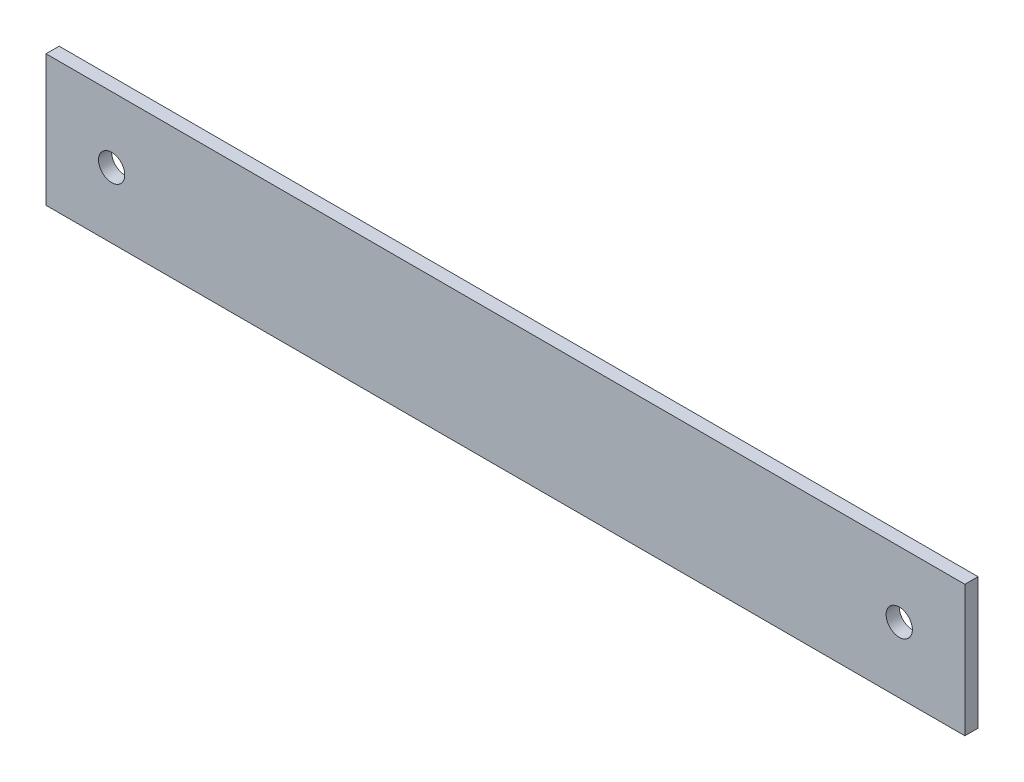
ISO-10303-21;
HEADER;
FILE_DESCRIPTION(('STEP AP214'),'2;1');
FILE_NAME('part.step','',(''),(''),'','','');
FILE_SCHEMA(('AUTOMOTIVE_DESIGN { 1 0 10303 214 1 1 1 1 }'));
ENDSEC;
DATA;
#1=APPLICATION_CONTEXT('core data for automotive mechanical design processes');
#2=APPLICATION_PROTOCOL_DEFINITION('international standard','automotive_design',2000,#1);
#3=PRODUCT_CONTEXT('',#1,'mechanical');
#4=PRODUCT('Part','Part','',(#3));
#5=PRODUCT_RELATED_PRODUCT_CATEGORY('part','',(#4));
#6=PRODUCT_DEFINITION_FORMATION('','',#4);
#7=PRODUCT_DEFINITION_CONTEXT('part definition',#1,'design');
#8=PRODUCT_DEFINITION('design','',#6,#7);
#9=PRODUCT_DEFINITION_SHAPE('','',#8);
#10=(LENGTH_UNIT() NAMED_UNIT(*) SI_UNIT(.MILLI.,.METRE.));
#11=(NAMED_UNIT(*) PLANE_ANGLE_UNIT() SI_UNIT($,.RADIAN.));
#12=(NAMED_UNIT(*) SI_UNIT($,.STERADIAN.) SOLID_ANGLE_UNIT());
#13=UNCERTAINTY_MEASURE_WITH_UNIT(LENGTH_MEASURE(1.E-05),#10,'distance_accuracy_value','');
#14=(GEOMETRIC_REPRESENTATION_CONTEXT(3) GLOBAL_UNCERTAINTY_ASSIGNED_CONTEXT((#13)) GLOBAL_UNIT_ASSIGNED_CONTEXT((#10,
#11,#12)) REPRESENTATION_CONTEXT('',''));
#15=CARTESIAN_POINT('',(0.,0.,0.));
#16=DIRECTION('',(0.,0.,1.));
#17=DIRECTION('',(1.,0.,0.));
#18=AXIS2_PLACEMENT_3D('',#15,#16,#17);
#19=CARTESIAN_POINT('',(70.,-10.,2.));
#20=DIRECTION('',(-1.,0.,0.));
#21=DIRECTION('',(0.,0.,1.));
#22=AXIS2_PLACEMENT_3D('',#19,#20,#21);
#23=PLANE('',#22);
#24=DIRECTION('',(0.,1.,0.));
#25=VECTOR('',#24,1.);
#26=CARTESIAN_POINT('',(70.,-10.,0.));
#27=LINE('',#26,#25);
#28=CARTESIAN_POINT('',(70.,-10.,0.));
#29=VERTEX_POINT('',#28);
#30=CARTESIAN_POINT('',(70.,10.,0.));
#31=VERTEX_POINT('',#30);
#32=EDGE_CURVE('E97',#29,#31,#27,.T.);
#33=ORIENTED_EDGE('',*,*,#32,.T.);
#34=DIRECTION('',(0.,0.,-1.));
#35=VECTOR('',#34,1.);
#36=CARTESIAN_POINT('',(70.,10.,2.));
#37=LINE('',#36,#35);
#38=CARTESIAN_POINT('',(70.,10.,2.));
#39=VERTEX_POINT('',#38);
#40=EDGE_CURVE('E11',#39,#31,#37,.T.);
#41=ORIENTED_EDGE('',*,*,#40,.F.);
#42=DIRECTION('',(0.,1.,0.));
#43=VECTOR('',#42,1.);
#44=CARTESIAN_POINT('',(70.,-10.,2.));
#45=LINE('',#44,#43);
#46=CARTESIAN_POINT('',(70.,-10.,2.));
#47=VERTEX_POINT('',#46);
#48=EDGE_CURVE('E85',#47,#39,#45,.T.);
#49=ORIENTED_EDGE('',*,*,#48,.F.);
#50=DIRECTION('',(0.,0.,-1.));
#51=VECTOR('',#50,1.);
#52=CARTESIAN_POINT('',(70.,-10.,2.));
#53=LINE('',#52,#51);
#54=EDGE_CURVE('E93',#47,#29,#53,.T.);
#55=ORIENTED_EDGE('',*,*,#54,.T.);
#56=EDGE_LOOP('',(#33,#41,#49,#55));
#57=FACE_BOUND('',#56,.T.);
#58=ADVANCED_FACE('F34',(#57),#23,.F.);
#59=CARTESIAN_POINT('',(-70.,10.,2.));
#60=DIRECTION('',(0.,-1.,0.));
#61=DIRECTION('',(0.,0.,-1.));
#62=AXIS2_PLACEMENT_3D('',#59,#60,#61);
#63=PLANE('',#62);
#64=DIRECTION('',(-1.,0.,0.));
#65=VECTOR('',#64,1.);
#66=CARTESIAN_POINT('',(-70.,10.,0.));
#67=LINE('',#66,#65);
#68=CARTESIAN_POINT('',(-70.,10.,0.));
#69=VERTEX_POINT('',#68);
#70=EDGE_CURVE('E89',#31,#69,#67,.T.);
#71=ORIENTED_EDGE('',*,*,#70,.T.);
#72=DIRECTION('',(0.,0.,-1.));
#73=VECTOR('',#72,1.);
#74=CARTESIAN_POINT('',(-70.,10.,2.));
#75=LINE('',#74,#73);
#76=CARTESIAN_POINT('',(-70.,10.,2.));
#77=VERTEX_POINT('',#76);
#78=EDGE_CURVE('E42',#77,#69,#75,.T.);
#79=ORIENTED_EDGE('',*,*,#78,.F.);
#80=DIRECTION('',(-1.,0.,0.));
#81=VECTOR('',#80,1.);
#82=CARTESIAN_POINT('',(-70.,10.,2.));
#83=LINE('',#82,#81);
#84=EDGE_CURVE('E80',#39,#77,#83,.T.);
#85=ORIENTED_EDGE('',*,*,#84,.F.);
#86=ORIENTED_EDGE('',*,*,#40,.T.);
#87=EDGE_LOOP('',(#71,#79,#85,#86));
#88=FACE_BOUND('',#87,.T.);
#89=ADVANCED_FACE('F88',(#88),#63,.F.);
#90=CARTESIAN_POINT('',(-70.,-10.,2.));
#91=DIRECTION('',(1.,0.,0.));
#92=DIRECTION('',(0.,0.,-1.));
#93=AXIS2_PLACEMENT_3D('',#90,#91,#92);
#94=PLANE('',#93);
#95=DIRECTION('',(0.,-1.,0.));
#96=VECTOR('',#95,1.);
#97=CARTESIAN_POINT('',(-70.,-10.,0.));
#98=LINE('',#97,#96);
#99=CARTESIAN_POINT('',(-70.,-10.,0.));
#100=VERTEX_POINT('',#99);
#101=EDGE_CURVE('E67',#69,#100,#98,.T.);
#102=ORIENTED_EDGE('',*,*,#101,.T.);
#103=DIRECTION('',(0.,0.,-1.));
#104=VECTOR('',#103,1.);
#105=CARTESIAN_POINT('',(-70.,-10.,2.));
#106=LINE('',#105,#104);
#107=CARTESIAN_POINT('',(-70.,-10.,2.));
#108=VERTEX_POINT('',#107);
#109=EDGE_CURVE('E90',#108,#100,#106,.T.);
#110=ORIENTED_EDGE('',*,*,#109,.F.);
#111=DIRECTION('',(0.,-1.,0.));
#112=VECTOR('',#111,1.);
#113=CARTESIAN_POINT('',(-70.,-10.,2.));
#114=LINE('',#113,#112);
#115=EDGE_CURVE('E83',#77,#108,#114,.T.);
#116=ORIENTED_EDGE('',*,*,#115,.F.);
#117=ORIENTED_EDGE('',*,*,#78,.T.);
#118=EDGE_LOOP('',(#102,#110,#116,#117));
#119=FACE_BOUND('',#118,.T.);
#120=ADVANCED_FACE('F91',(#119),#94,.F.);
#121=CARTESIAN_POINT('',(-70.,-10.,2.));
#122=DIRECTION('',(0.,1.,0.));
#123=DIRECTION('',(0.,0.,1.));
#124=AXIS2_PLACEMENT_3D('',#121,#122,#123);
#125=PLANE('',#124);
#126=DIRECTION('',(1.,0.,0.));
#127=VECTOR('',#126,1.);
#128=CARTESIAN_POINT('',(-70.,-10.,0.));
#129=LINE('',#128,#127);
#130=EDGE_CURVE('E73',#100,#29,#129,.T.);
#131=ORIENTED_EDGE('',*,*,#130,.T.);
#132=ORIENTED_EDGE('',*,*,#54,.F.);
#133=DIRECTION('',(1.,0.,0.));
#134=VECTOR('',#133,1.);
#135=CARTESIAN_POINT('',(-70.,-10.,2.));
#136=LINE('',#135,#134);
#137=EDGE_CURVE('E50',#108,#47,#136,.T.);
#138=ORIENTED_EDGE('',*,*,#137,.F.);
#139=ORIENTED_EDGE('',*,*,#109,.T.);
#140=EDGE_LOOP('',(#131,#132,#138,#139));
#141=FACE_BOUND('',#140,.T.);
#142=ADVANCED_FACE('F105',(#141),#125,.F.);
#143=CARTESIAN_POINT('',(0.,0.,2.));
#144=DIRECTION('',(0.,0.,-1.));
#145=DIRECTION('',(-1.,0.,0.));
#146=AXIS2_PLACEMENT_3D('',#143,#144,#145);
#147=PLANE('',#146);
#148=CARTESIAN_POINT('',(-60.,0.,2.));
#149=DIRECTION('',(0.,0.,1.));
#150=DIRECTION('',(1.,0.,0.));
#151=AXIS2_PLACEMENT_3D('',#148,#149,#150);
#152=CIRCLE('',#151,2.);
#153=CARTESIAN_POINT('',(-58.,0.,2.));
#154=VERTEX_POINT('',#153);
#155=EDGE_CURVE('E117',#154,#154,#152,.T.);
#156=ORIENTED_EDGE('',*,*,#155,.F.);
#157=EDGE_LOOP('',(#156));
#158=FACE_BOUND('',#157,.T.);
#159=CARTESIAN_POINT('',(60.,0.,2.));
#160=DIRECTION('',(0.,0.,1.));
#161=DIRECTION('',(1.,0.,0.));
#162=AXIS2_PLACEMENT_3D('',#159,#160,#161);
#163=CIRCLE('',#162,2.);
#164=CARTESIAN_POINT('',(62.,0.,2.));
#165=VERTEX_POINT('',#164);
#166=EDGE_CURVE('E111',#165,#165,#163,.T.);
#167=ORIENTED_EDGE('',*,*,#166,.F.);
#168=EDGE_LOOP('',(#167));
#169=FACE_BOUND('',#168,.T.);
#170=ORIENTED_EDGE('',*,*,#48,.T.);
#171=ORIENTED_EDGE('',*,*,#84,.T.);
#172=ORIENTED_EDGE('',*,*,#115,.T.);
#173=ORIENTED_EDGE('',*,*,#137,.T.);
#174=EDGE_LOOP('',(#170,#171,#172,#173));
#175=FACE_BOUND('',#174,.T.);
#176=ADVANCED_FACE('F81',(#158,#169,#175),#147,.F.);
#177=CARTESIAN_POINT('',(0.,0.,0.));
#178=DIRECTION('',(0.,0.,-1.));
#179=DIRECTION('',(-1.,0.,0.));
#180=AXIS2_PLACEMENT_3D('',#177,#178,#179);
#181=PLANE('',#180);
#182=CARTESIAN_POINT('',(-60.,0.,0.));
#183=DIRECTION('',(0.,0.,1.));
#184=DIRECTION('',(1.,0.,0.));
#185=AXIS2_PLACEMENT_3D('',#182,#183,#184);
#186=CIRCLE('',#185,2.);
#187=CARTESIAN_POINT('',(-58.,0.,0.));
#188=VERTEX_POINT('',#187);
#189=EDGE_CURVE('E100',#188,#188,#186,.T.);
#190=ORIENTED_EDGE('',*,*,#189,.T.);
#191=EDGE_LOOP('',(#190));
#192=FACE_BOUND('',#191,.T.);
#193=CARTESIAN_POINT('',(60.,0.,0.));
#194=DIRECTION('',(0.,0.,1.));
#195=DIRECTION('',(1.,0.,0.));
#196=AXIS2_PLACEMENT_3D('',#193,#194,#195);
#197=CIRCLE('',#196,2.);
#198=CARTESIAN_POINT('',(62.,0.,0.));
#199=VERTEX_POINT('',#198);
#200=EDGE_CURVE('E114',#199,#199,#197,.T.);
#201=ORIENTED_EDGE('',*,*,#200,.T.);
#202=EDGE_LOOP('',(#201));
#203=FACE_BOUND('',#202,.T.);
#204=ORIENTED_EDGE('',*,*,#32,.F.);
#205=ORIENTED_EDGE('',*,*,#130,.F.);
#206=ORIENTED_EDGE('',*,*,#101,.F.);
#207=ORIENTED_EDGE('',*,*,#70,.F.);
#208=EDGE_LOOP('',(#204,#205,#206,#207));
#209=FACE_BOUND('',#208,.T.);
#210=ADVANCED_FACE('F108',(#192,#203,#209),#181,.T.);
#211=CARTESIAN_POINT('',(60.,0.,0.));
#212=DIRECTION('',(0.,0.,1.));
#213=DIRECTION('',(1.,0.,0.));
#214=AXIS2_PLACEMENT_3D('',#211,#212,#213);
#215=CYLINDRICAL_SURFACE('',#214,2.);
#216=ORIENTED_EDGE('',*,*,#200,.F.);
#217=EDGE_LOOP('',(#216));
#218=FACE_BOUND('',#217,.T.);
#219=ORIENTED_EDGE('',*,*,#166,.T.);
#220=EDGE_LOOP('',(#219));
#221=FACE_BOUND('',#220,.T.);
#222=ADVANCED_FACE('F128',(#218,#221),#215,.F.);
#223=CARTESIAN_POINT('',(-60.,0.,0.));
#224=DIRECTION('',(0.,0.,1.));
#225=DIRECTION('',(1.,0.,0.));
#226=AXIS2_PLACEMENT_3D('',#223,#224,#225);
#227=CYLINDRICAL_SURFACE('',#226,2.);
#228=ORIENTED_EDGE('',*,*,#189,.F.);
#229=EDGE_LOOP('',(#228));
#230=FACE_BOUND('',#229,.T.);
#231=ORIENTED_EDGE('',*,*,#155,.T.);
#232=EDGE_LOOP('',(#231));
#233=FACE_BOUND('',#232,.T.);
#234=ADVANCED_FACE('F125',(#230,#233),#227,.F.);
#235=CLOSED_SHELL('',(#58,#89,#120,#142,#176,#210,#222,#234));
#236=MANIFOLD_SOLID_BREP('B2',#235);
#237=ADVANCED_BREP_SHAPE_REPRESENTATION('',(#18,#236),#14);
#238=SHAPE_DEFINITION_REPRESENTATION(#9,#237);
ENDSEC;
END-ISO-10303-21;
